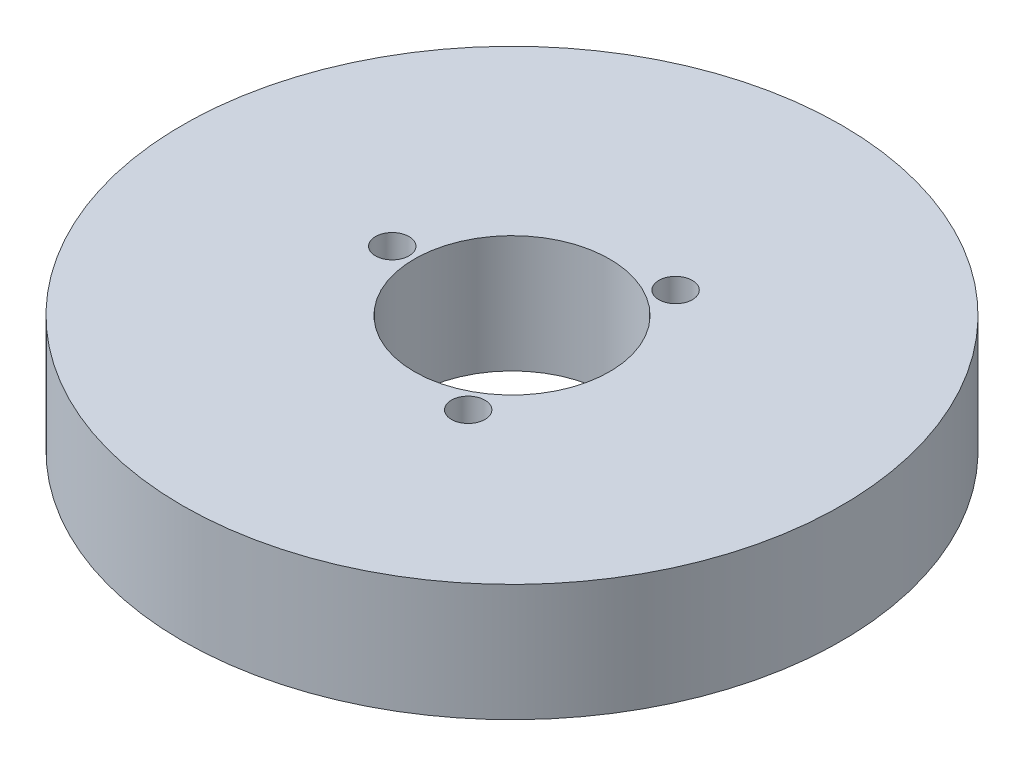
ISO-10303-21;
HEADER;
FILE_DESCRIPTION(('STEP AP214'),'2;1');
FILE_NAME('part.step','',(''),(''),'','','');
FILE_SCHEMA(('AUTOMOTIVE_DESIGN { 1 0 10303 214 1 1 1 1 }'));
ENDSEC;
DATA;
#1=APPLICATION_CONTEXT('core data for automotive mechanical design processes');
#2=APPLICATION_PROTOCOL_DEFINITION('international standard','automotive_design',2000,#1);
#3=PRODUCT_CONTEXT('',#1,'mechanical');
#4=PRODUCT('Part','Part','',(#3));
#5=PRODUCT_RELATED_PRODUCT_CATEGORY('part','',(#4));
#6=PRODUCT_DEFINITION_FORMATION('','',#4);
#7=PRODUCT_DEFINITION_CONTEXT('part definition',#1,'design');
#8=PRODUCT_DEFINITION('design','',#6,#7);
#9=PRODUCT_DEFINITION_SHAPE('','',#8);
#10=(LENGTH_UNIT() NAMED_UNIT(*) SI_UNIT(.MILLI.,.METRE.));
#11=(NAMED_UNIT(*) PLANE_ANGLE_UNIT() SI_UNIT($,.RADIAN.));
#12=(NAMED_UNIT(*) SI_UNIT($,.STERADIAN.) SOLID_ANGLE_UNIT());
#13=UNCERTAINTY_MEASURE_WITH_UNIT(LENGTH_MEASURE(1.E-05),#10,'distance_accuracy_value','');
#14=(GEOMETRIC_REPRESENTATION_CONTEXT(3) GLOBAL_UNCERTAINTY_ASSIGNED_CONTEXT((#13)) GLOBAL_UNIT_ASSIGNED_CONTEXT((#10,
#11,#12)) REPRESENTATION_CONTEXT('',''));
#15=CARTESIAN_POINT('',(0.,0.,0.));
#16=DIRECTION('',(0.,0.,1.));
#17=DIRECTION('',(1.,0.,0.));
#18=AXIS2_PLACEMENT_3D('',#15,#16,#17);
#19=CARTESIAN_POINT('',(0.,24.,0.));
#20=DIRECTION('',(0.,-1.,0.));
#21=DIRECTION('',(0.,0.,-1.));
#22=AXIS2_PLACEMENT_3D('',#19,#20,#21);
#23=CYLINDRICAL_SURFACE('',#22,67.5);
#24=CARTESIAN_POINT('',(0.,24.,0.));
#25=DIRECTION('',(0.,1.,0.));
#26=DIRECTION('',(0.,0.,1.));
#27=AXIS2_PLACEMENT_3D('',#24,#25,#26);
#28=CIRCLE('',#27,67.5);
#29=CARTESIAN_POINT('',(0.,24.,67.5));
#30=VERTEX_POINT('',#29);
#31=EDGE_CURVE('E10',#30,#30,#28,.T.);
#32=ORIENTED_EDGE('',*,*,#31,.F.);
#33=EDGE_LOOP('',(#32));
#34=FACE_BOUND('',#33,.T.);
#35=CARTESIAN_POINT('',(0.,0.,0.));
#36=DIRECTION('',(0.,1.,0.));
#37=DIRECTION('',(0.,0.,1.));
#38=AXIS2_PLACEMENT_3D('',#35,#36,#37);
#39=CIRCLE('',#38,67.5);
#40=CARTESIAN_POINT('',(0.,0.,67.5));
#41=VERTEX_POINT('',#40);
#42=EDGE_CURVE('E37',#41,#41,#39,.T.);
#43=ORIENTED_EDGE('',*,*,#42,.T.);
#44=EDGE_LOOP('',(#43));
#45=FACE_BOUND('',#44,.T.);
#46=ADVANCED_FACE('F40',(#34,#45),#23,.T.);
#47=CARTESIAN_POINT('',(0.,24.,0.));
#48=DIRECTION('',(0.,1.,0.));
#49=DIRECTION('',(0.,0.,1.));
#50=AXIS2_PLACEMENT_3D('',#47,#48,#49);
#51=PLANE('',#50);
#52=CARTESIAN_POINT('',(12.2641494560278,24.,21.2421299694582));
#53=DIRECTION('',(0.,1.,0.));
#54=DIRECTION('',(0.866025403784436,0.,-0.500000000000004));
#55=AXIS2_PLACEMENT_3D('',#52,#53,#54);
#56=CIRCLE('',#55,3.43480526939864);
#57=CARTESIAN_POINT('',(12.2641494560278,24.,24.6769352388568));
#58=VERTEX_POINT('',#57);
#59=EDGE_CURVE('E70',#58,#58,#56,.T.);
#60=ORIENTED_EDGE('',*,*,#59,.F.);
#61=EDGE_LOOP('',(#60));
#62=FACE_BOUND('',#61,.T.);
#63=CARTESIAN_POINT('',(12.2641494560275,24.,-21.2421299694584));
#64=DIRECTION('',(0.,1.,0.));
#65=DIRECTION('',(-0.866025403784443,0.,-0.499999999999992));
#66=AXIS2_PLACEMENT_3D('',#63,#64,#65);
#67=CIRCLE('',#66,3.43480526939864);
#68=CARTESIAN_POINT('',(12.2641494560275,24.,-17.8073247000597));
#69=VERTEX_POINT('',#68);
#70=EDGE_CURVE('E61',#69,#69,#67,.T.);
#71=ORIENTED_EDGE('',*,*,#70,.F.);
#72=EDGE_LOOP('',(#71));
#73=FACE_BOUND('',#72,.T.);
#74=CARTESIAN_POINT('',(-24.5282989120555,24.,0.));
#75=DIRECTION('',(0.,1.,0.));
#76=DIRECTION('',(0.,0.,1.));
#77=AXIS2_PLACEMENT_3D('',#74,#75,#76);
#78=CIRCLE('',#77,3.43480526939864);
#79=CARTESIAN_POINT('',(-24.5282989120555,24.,3.43480526939864));
#80=VERTEX_POINT('',#79);
#81=EDGE_CURVE('E54',#80,#80,#78,.T.);
#82=ORIENTED_EDGE('',*,*,#81,.F.);
#83=EDGE_LOOP('',(#82));
#84=FACE_BOUND('',#83,.T.);
#85=CARTESIAN_POINT('',(0.,24.,0.));
#86=DIRECTION('',(0.,1.,0.));
#87=DIRECTION('',(0.,0.,1.));
#88=AXIS2_PLACEMENT_3D('',#85,#86,#87);
#89=CIRCLE('',#88,20.);
#90=CARTESIAN_POINT('',(0.,24.,20.));
#91=VERTEX_POINT('',#90);
#92=EDGE_CURVE('E50',#91,#91,#89,.T.);
#93=ORIENTED_EDGE('',*,*,#92,.F.);
#94=EDGE_LOOP('',(#93));
#95=FACE_BOUND('',#94,.T.);
#96=ORIENTED_EDGE('',*,*,#31,.T.);
#97=EDGE_LOOP('',(#96));
#98=FACE_BOUND('',#97,.T.);
#99=ADVANCED_FACE('F85',(#62,#73,#84,#95,#98),#51,.T.);
#100=CARTESIAN_POINT('',(0.,0.,0.));
#101=DIRECTION('',(0.,1.,0.));
#102=DIRECTION('',(0.,0.,1.));
#103=AXIS2_PLACEMENT_3D('',#100,#101,#102);
#104=PLANE('',#103);
#105=CARTESIAN_POINT('',(0.,0.,0.));
#106=DIRECTION('',(0.,1.,0.));
#107=DIRECTION('',(0.,0.,1.));
#108=AXIS2_PLACEMENT_3D('',#105,#106,#107);
#109=CIRCLE('',#108,20.);
#110=CARTESIAN_POINT('',(0.,0.,20.));
#111=VERTEX_POINT('',#110);
#112=EDGE_CURVE('E47',#111,#111,#109,.T.);
#113=ORIENTED_EDGE('',*,*,#112,.T.);
#114=EDGE_LOOP('',(#113));
#115=FACE_BOUND('',#114,.T.);
#116=ORIENTED_EDGE('',*,*,#42,.F.);
#117=EDGE_LOOP('',(#116));
#118=FACE_BOUND('',#117,.T.);
#119=ADVANCED_FACE('F84',(#115,#118),#104,.F.);
#120=CARTESIAN_POINT('',(0.,24.,0.));
#121=DIRECTION('',(0.,-1.,0.));
#122=DIRECTION('',(0.,0.,-1.));
#123=AXIS2_PLACEMENT_3D('',#120,#121,#122);
#124=CYLINDRICAL_SURFACE('',#123,20.);
#125=ORIENTED_EDGE('',*,*,#92,.T.);
#126=EDGE_LOOP('',(#125));
#127=FACE_BOUND('',#126,.T.);
#128=ORIENTED_EDGE('',*,*,#112,.F.);
#129=EDGE_LOOP('',(#128));
#130=FACE_BOUND('',#129,.T.);
#131=ADVANCED_FACE('F91',(#127,#130),#124,.F.);
#132=CARTESIAN_POINT('',(-24.5282989120555,5.01780657933037,0.));
#133=DIRECTION('',(0.,1.,0.));
#134=DIRECTION('',(0.,0.,1.));
#135=AXIS2_PLACEMENT_3D('',#132,#133,#134);
#136=CYLINDRICAL_SURFACE('',#135,3.43480526939864);
#137=CARTESIAN_POINT('',(-24.5282989120555,5.01780657933037,0.));
#138=DIRECTION('',(0.,1.,0.));
#139=DIRECTION('',(0.,0.,1.));
#140=AXIS2_PLACEMENT_3D('',#137,#138,#139);
#141=CIRCLE('',#140,3.43480526939864);
#142=CARTESIAN_POINT('',(-24.5282989120555,5.01780657933037,3.43480526939864));
#143=VERTEX_POINT('',#142);
#144=EDGE_CURVE('E55',#143,#143,#141,.T.);
#145=CARTESIAN_POINT('',(-24.5282989120555,5.01780657933037,3.43480526939864));
#146=CARTESIAN_POINT('',(-24.5282989120555,5.21553776079568,3.43480526939864));
#147=CARTESIAN_POINT('',(-24.5282989120555,5.41326894226099,3.43480526939864));
#148=CARTESIAN_POINT('',(-24.5282989120555,5.80873130519161,3.43480526939864));
#149=CARTESIAN_POINT('',(-24.5282989120555,6.00646248665692,3.43480526939864));
#150=CARTESIAN_POINT('',(-24.5282989120555,6.40192484958753,3.43480526939864));
#151=CARTESIAN_POINT('',(-24.5282989120555,6.59965603105284,3.43480526939864));
#152=CARTESIAN_POINT('',(-24.5282989120555,6.99511839398346,3.43480526939864));
#153=CARTESIAN_POINT('',(-24.5282989120555,7.19284957544877,3.43480526939864));
#154=CARTESIAN_POINT('',(-24.5282989120555,7.58831193837939,3.43480526939864));
#155=CARTESIAN_POINT('',(-24.5282989120555,7.7860431198447,3.43480526939864));
#156=CARTESIAN_POINT('',(-24.5282989120555,8.18150548277531,3.43480526939864));
#157=CARTESIAN_POINT('',(-24.5282989120555,8.37923666424062,3.43480526939864));
#158=CARTESIAN_POINT('',(-24.5282989120555,8.77469902717124,3.43480526939864));
#159=CARTESIAN_POINT('',(-24.5282989120555,8.97243020863655,3.43480526939864));
#160=CARTESIAN_POINT('',(-24.5282989120555,9.36789257156716,3.43480526939864));
#161=CARTESIAN_POINT('',(-24.5282989120555,9.56562375303247,3.43480526939864));
#162=CARTESIAN_POINT('',(-24.5282989120555,9.96108611596309,3.43480526939864));
#163=CARTESIAN_POINT('',(-24.5282989120555,10.1588172974284,3.43480526939864));
#164=CARTESIAN_POINT('',(-24.5282989120555,10.554279660359,3.43480526939864));
#165=CARTESIAN_POINT('',(-24.5282989120555,10.7520108418243,3.43480526939864));
#166=CARTESIAN_POINT('',(-24.5282989120555,11.1474732047549,3.43480526939864));
#167=CARTESIAN_POINT('',(-24.5282989120555,11.3452043862202,3.43480526939864));
#168=CARTESIAN_POINT('',(-24.5282989120555,11.7406667491509,3.43480526939864));
#169=CARTESIAN_POINT('',(-24.5282989120555,11.9383979306162,3.43480526939864));
#170=CARTESIAN_POINT('',(-24.5282989120555,12.3338602935468,3.43480526939864));
#171=CARTESIAN_POINT('',(-24.5282989120555,12.5315914750121,3.43480526939864));
#172=CARTESIAN_POINT('',(-24.5282989120555,12.9270538379427,3.43480526939864));
#173=CARTESIAN_POINT('',(-24.5282989120555,13.124785019408,3.43480526939864));
#174=CARTESIAN_POINT('',(-24.5282989120555,13.5202473823386,3.43480526939864));
#175=CARTESIAN_POINT('',(-24.5282989120555,13.717978563804,3.43480526939864));
#176=CARTESIAN_POINT('',(-24.5282989120555,14.1134409267346,3.43480526939864));
#177=CARTESIAN_POINT('',(-24.5282989120555,14.3111721081999,3.43480526939864));
#178=CARTESIAN_POINT('',(-24.5282989120555,14.7066344711305,3.43480526939864));
#179=CARTESIAN_POINT('',(-24.5282989120555,14.9043656525958,3.43480526939864));
#180=CARTESIAN_POINT('',(-24.5282989120555,15.2998280155264,3.43480526939864));
#181=CARTESIAN_POINT('',(-24.5282989120555,15.4975591969917,3.43480526939864));
#182=CARTESIAN_POINT('',(-24.5282989120555,15.8930215599223,3.43480526939864));
#183=CARTESIAN_POINT('',(-24.5282989120555,16.0907527413877,3.43480526939864));
#184=CARTESIAN_POINT('',(-24.5282989120555,16.4862151043183,3.43480526939864));
#185=CARTESIAN_POINT('',(-24.5282989120555,16.6839462857836,3.43480526939864));
#186=CARTESIAN_POINT('',(-24.5282989120555,17.0794086487142,3.43480526939864));
#187=CARTESIAN_POINT('',(-24.5282989120555,17.2771398301795,3.43480526939864));
#188=CARTESIAN_POINT('',(-24.5282989120555,17.6726021931101,3.43480526939864));
#189=CARTESIAN_POINT('',(-24.5282989120555,17.8703333745754,3.43480526939864));
#190=CARTESIAN_POINT('',(-24.5282989120555,18.265795737506,3.43480526939864));
#191=CARTESIAN_POINT('',(-24.5282989120555,18.4635269189714,3.43480526939864));
#192=CARTESIAN_POINT('',(-24.5282989120555,18.858989281902,3.43480526939864));
#193=CARTESIAN_POINT('',(-24.5282989120555,19.0567204633673,3.43480526939864));
#194=CARTESIAN_POINT('',(-24.5282989120555,19.4521828262979,3.43480526939864));
#195=CARTESIAN_POINT('',(-24.5282989120555,19.6499140077632,3.43480526939864));
#196=CARTESIAN_POINT('',(-24.5282989120555,20.0453763706938,3.43480526939864));
#197=CARTESIAN_POINT('',(-24.5282989120555,20.2431075521591,3.43480526939864));
#198=CARTESIAN_POINT('',(-24.5282989120555,20.6385699150898,3.43480526939864));
#199=CARTESIAN_POINT('',(-24.5282989120555,20.8363010965551,3.43480526939864));
#200=CARTESIAN_POINT('',(-24.5282989120555,21.2317634594857,3.43480526939864));
#201=CARTESIAN_POINT('',(-24.5282989120555,21.429494640951,3.43480526939864));
#202=CARTESIAN_POINT('',(-24.5282989120555,21.8249570038816,3.43480526939864));
#203=CARTESIAN_POINT('',(-24.5282989120555,22.0226881853469,3.43480526939864));
#204=CARTESIAN_POINT('',(-24.5282989120555,22.4181505482775,3.43480526939864));
#205=CARTESIAN_POINT('',(-24.5282989120555,22.6158817297428,3.43480526939864));
#206=CARTESIAN_POINT('',(-24.5282989120555,23.0113440926735,3.43480526939864));
#207=CARTESIAN_POINT('',(-24.5282989120555,23.2090752741388,3.43480526939864));
#208=CARTESIAN_POINT('',(-24.5282989120555,23.6045376370694,3.43480526939864));
#209=CARTESIAN_POINT('',(-24.5282989120555,23.8022688185347,3.43480526939864));
#210=CARTESIAN_POINT('',(-24.5282989120555,24.,3.43480526939864));
#211=B_SPLINE_CURVE_WITH_KNOTS('',3,(#145,#146,#147,#148,#149,#150,#151,#152,#153,#154,#155,
#156,#157,#158,#159,#160,#161,#162,#163,#164,#165,#166,#167,#168,#169,#170,#171,#172,#173,#174,
#175,#176,#177,#178,#179,#180,#181,#182,#183,#184,#185,#186,#187,#188,#189,#190,#191,#192,#193,
#194,#195,#196,#197,#198,#199,#200,#201,#202,#203,#204,#205,#206,#207,#208,#209,#210),
.UNSPECIFIED.,.F.,.F.,(4,2,2,2,2,2,2,2,2,2,2,2,2,2,2,2,2,2,2,2,2,2,2,2,2,2,2,2,2,2,2,2,4),(0.,
0.593193544395926,1.18638708879185,1.77958063318778,2.3727741775837,2.96596772197963,
3.55916126637555,4.15235481077148,4.74554835516741,5.33874189956333,5.93193544395926,
6.52512898835518,7.11832253275111,7.71151607714703,8.30470962154296,8.89790316593889,
9.49109671033481,10.0842902547307,10.6774837991267,11.2706773435226,11.8638708879185,
12.4570644323144,13.0502579767104,13.6434515211063,14.2366450655022,14.8298386098981,
15.4230321542941,16.01622569869,16.6094192430859,17.2026127874818,17.7958063318778,
18.3889998762737,18.9821934206696),.UNSPECIFIED.);
#212=EDGE_CURVE('BSEAM96',#143,#80,#211,.T.);
#213=ORIENTED_EDGE('',*,*,#144,.F.);
#214=ORIENTED_EDGE('',*,*,#81,.T.);
#215=ORIENTED_EDGE('',*,*,#212,.T.);
#216=ORIENTED_EDGE('',*,*,#212,.F.);
#217=EDGE_LOOP('',(#213,#215,#214,#216));
#218=FACE_BOUND('',#217,.T.);
#219=ADVANCED_FACE('F96',(#218),#136,.F.);
#220=CARTESIAN_POINT('',(-24.5282989120555,5.01780657933037,0.));
#221=DIRECTION('',(0.,1.,0.));
#222=DIRECTION('',(0.,0.,1.));
#223=AXIS2_PLACEMENT_3D('',#220,#221,#222);
#224=PLANE('',#223);
#225=ORIENTED_EDGE('',*,*,#144,.T.);
#226=EDGE_LOOP('',(#225));
#227=FACE_BOUND('',#226,.T.);
#228=ADVANCED_FACE('F127',(#227),#224,.T.);
#229=CARTESIAN_POINT('',(12.2641494560275,5.01780657933037,-21.2421299694584));
#230=DIRECTION('',(0.,1.,0.));
#231=DIRECTION('',(0.,0.,1.));
#232=AXIS2_PLACEMENT_3D('',#229,#230,#231);
#233=CYLINDRICAL_SURFACE('',#232,3.43480526939864);
#234=CARTESIAN_POINT('',(12.2641494560275,5.01780657933037,-21.2421299694584));
#235=DIRECTION('',(0.,1.,0.));
#236=DIRECTION('',(-0.866025403784443,0.,-0.499999999999992));
#237=AXIS2_PLACEMENT_3D('',#234,#235,#236);
#238=CIRCLE('',#237,3.43480526939864);
#239=CARTESIAN_POINT('',(12.2641494560275,5.01780657933037,-17.8073247000597));
#240=VERTEX_POINT('',#239);
#241=EDGE_CURVE('E63',#240,#240,#238,.T.);
#242=CARTESIAN_POINT('',(12.2641494560275,5.01780657933037,-17.8073247000597));
#243=CARTESIAN_POINT('',(12.2641494560275,5.21553776079568,-17.8073247000597));
#244=CARTESIAN_POINT('',(12.2641494560275,5.41326894226099,-17.8073247000597));
#245=CARTESIAN_POINT('',(12.2641494560275,5.80873130519161,-17.8073247000597));
#246=CARTESIAN_POINT('',(12.2641494560275,6.00646248665692,-17.8073247000597));
#247=CARTESIAN_POINT('',(12.2641494560275,6.40192484958753,-17.8073247000597));
#248=CARTESIAN_POINT('',(12.2641494560275,6.59965603105284,-17.8073247000597));
#249=CARTESIAN_POINT('',(12.2641494560275,6.99511839398346,-17.8073247000597));
#250=CARTESIAN_POINT('',(12.2641494560275,7.19284957544877,-17.8073247000597));
#251=CARTESIAN_POINT('',(12.2641494560275,7.58831193837939,-17.8073247000597));
#252=CARTESIAN_POINT('',(12.2641494560275,7.7860431198447,-17.8073247000597));
#253=CARTESIAN_POINT('',(12.2641494560275,8.18150548277531,-17.8073247000597));
#254=CARTESIAN_POINT('',(12.2641494560275,8.37923666424062,-17.8073247000597));
#255=CARTESIAN_POINT('',(12.2641494560275,8.77469902717124,-17.8073247000597));
#256=CARTESIAN_POINT('',(12.2641494560275,8.97243020863655,-17.8073247000597));
#257=CARTESIAN_POINT('',(12.2641494560275,9.36789257156716,-17.8073247000597));
#258=CARTESIAN_POINT('',(12.2641494560275,9.56562375303247,-17.8073247000597));
#259=CARTESIAN_POINT('',(12.2641494560275,9.96108611596309,-17.8073247000597));
#260=CARTESIAN_POINT('',(12.2641494560275,10.1588172974284,-17.8073247000597));
#261=CARTESIAN_POINT('',(12.2641494560275,10.554279660359,-17.8073247000597));
#262=CARTESIAN_POINT('',(12.2641494560275,10.7520108418243,-17.8073247000597));
#263=CARTESIAN_POINT('',(12.2641494560275,11.1474732047549,-17.8073247000597));
#264=CARTESIAN_POINT('',(12.2641494560275,11.3452043862202,-17.8073247000597));
#265=CARTESIAN_POINT('',(12.2641494560275,11.7406667491509,-17.8073247000597));
#266=CARTESIAN_POINT('',(12.2641494560275,11.9383979306162,-17.8073247000597));
#267=CARTESIAN_POINT('',(12.2641494560275,12.3338602935468,-17.8073247000597));
#268=CARTESIAN_POINT('',(12.2641494560275,12.5315914750121,-17.8073247000597));
#269=CARTESIAN_POINT('',(12.2641494560275,12.9270538379427,-17.8073247000597));
#270=CARTESIAN_POINT('',(12.2641494560275,13.124785019408,-17.8073247000597));
#271=CARTESIAN_POINT('',(12.2641494560275,13.5202473823386,-17.8073247000597));
#272=CARTESIAN_POINT('',(12.2641494560275,13.717978563804,-17.8073247000597));
#273=CARTESIAN_POINT('',(12.2641494560275,14.1134409267346,-17.8073247000597));
#274=CARTESIAN_POINT('',(12.2641494560275,14.3111721081999,-17.8073247000597));
#275=CARTESIAN_POINT('',(12.2641494560275,14.7066344711305,-17.8073247000597));
#276=CARTESIAN_POINT('',(12.2641494560275,14.9043656525958,-17.8073247000597));
#277=CARTESIAN_POINT('',(12.2641494560275,15.2998280155264,-17.8073247000597));
#278=CARTESIAN_POINT('',(12.2641494560275,15.4975591969917,-17.8073247000597));
#279=CARTESIAN_POINT('',(12.2641494560275,15.8930215599223,-17.8073247000597));
#280=CARTESIAN_POINT('',(12.2641494560275,16.0907527413877,-17.8073247000597));
#281=CARTESIAN_POINT('',(12.2641494560275,16.4862151043183,-17.8073247000597));
#282=CARTESIAN_POINT('',(12.2641494560275,16.6839462857836,-17.8073247000597));
#283=CARTESIAN_POINT('',(12.2641494560275,17.0794086487142,-17.8073247000597));
#284=CARTESIAN_POINT('',(12.2641494560275,17.2771398301795,-17.8073247000597));
#285=CARTESIAN_POINT('',(12.2641494560275,17.6726021931101,-17.8073247000597));
#286=CARTESIAN_POINT('',(12.2641494560275,17.8703333745754,-17.8073247000597));
#287=CARTESIAN_POINT('',(12.2641494560275,18.265795737506,-17.8073247000597));
#288=CARTESIAN_POINT('',(12.2641494560275,18.4635269189714,-17.8073247000597));
#289=CARTESIAN_POINT('',(12.2641494560275,18.858989281902,-17.8073247000597));
#290=CARTESIAN_POINT('',(12.2641494560275,19.0567204633673,-17.8073247000597));
#291=CARTESIAN_POINT('',(12.2641494560275,19.4521828262979,-17.8073247000597));
#292=CARTESIAN_POINT('',(12.2641494560275,19.6499140077632,-17.8073247000597));
#293=CARTESIAN_POINT('',(12.2641494560275,20.0453763706938,-17.8073247000597));
#294=CARTESIAN_POINT('',(12.2641494560275,20.2431075521591,-17.8073247000597));
#295=CARTESIAN_POINT('',(12.2641494560275,20.6385699150898,-17.8073247000597));
#296=CARTESIAN_POINT('',(12.2641494560275,20.8363010965551,-17.8073247000597));
#297=CARTESIAN_POINT('',(12.2641494560275,21.2317634594857,-17.8073247000597));
#298=CARTESIAN_POINT('',(12.2641494560275,21.429494640951,-17.8073247000597));
#299=CARTESIAN_POINT('',(12.2641494560275,21.8249570038816,-17.8073247000597));
#300=CARTESIAN_POINT('',(12.2641494560275,22.0226881853469,-17.8073247000597));
#301=CARTESIAN_POINT('',(12.2641494560275,22.4181505482775,-17.8073247000597));
#302=CARTESIAN_POINT('',(12.2641494560275,22.6158817297428,-17.8073247000597));
#303=CARTESIAN_POINT('',(12.2641494560275,23.0113440926735,-17.8073247000597));
#304=CARTESIAN_POINT('',(12.2641494560275,23.2090752741388,-17.8073247000597));
#305=CARTESIAN_POINT('',(12.2641494560275,23.6045376370694,-17.8073247000597));
#306=CARTESIAN_POINT('',(12.2641494560275,23.8022688185347,-17.8073247000597));
#307=CARTESIAN_POINT('',(12.2641494560275,24.,-17.8073247000597));
#308=B_SPLINE_CURVE_WITH_KNOTS('',3,(#242,#243,#244,#245,#246,#247,#248,#249,#250,#251,#252,
#253,#254,#255,#256,#257,#258,#259,#260,#261,#262,#263,#264,#265,#266,#267,#268,#269,#270,#271,
#272,#273,#274,#275,#276,#277,#278,#279,#280,#281,#282,#283,#284,#285,#286,#287,#288,#289,#290,
#291,#292,#293,#294,#295,#296,#297,#298,#299,#300,#301,#302,#303,#304,#305,#306,#307),
.UNSPECIFIED.,.F.,.F.,(4,2,2,2,2,2,2,2,2,2,2,2,2,2,2,2,2,2,2,2,2,2,2,2,2,2,2,2,2,2,2,2,4),(0.,
0.593193544395926,1.18638708879185,1.77958063318778,2.3727741775837,2.96596772197963,
3.55916126637555,4.15235481077148,4.74554835516741,5.33874189956333,5.93193544395926,
6.52512898835518,7.11832253275111,7.71151607714703,8.30470962154296,8.89790316593889,
9.49109671033481,10.0842902547307,10.6774837991267,11.2706773435226,11.8638708879185,
12.4570644323144,13.0502579767104,13.6434515211063,14.2366450655022,14.8298386098981,
15.4230321542941,16.01622569869,16.6094192430859,17.2026127874818,17.7958063318778,
18.3889998762737,18.9821934206696),.UNSPECIFIED.);
#309=EDGE_CURVE('BSEAM133',#240,#69,#308,.T.);
#310=ORIENTED_EDGE('',*,*,#241,.F.);
#311=ORIENTED_EDGE('',*,*,#70,.T.);
#312=ORIENTED_EDGE('',*,*,#309,.T.);
#313=ORIENTED_EDGE('',*,*,#309,.F.);
#314=EDGE_LOOP('',(#310,#312,#311,#313));
#315=FACE_BOUND('',#314,.T.);
#316=ADVANCED_FACE('F133',(#315),#233,.F.);
#317=CARTESIAN_POINT('',(12.2641494560275,5.01780657933037,-21.2421299694584));
#318=DIRECTION('',(0.,1.,0.));
#319=DIRECTION('',(-0.866025403784443,0.,-0.499999999999992));
#320=AXIS2_PLACEMENT_3D('',#317,#318,#319);
#321=PLANE('',#320);
#322=ORIENTED_EDGE('',*,*,#241,.T.);
#323=EDGE_LOOP('',(#322));
#324=FACE_BOUND('',#323,.T.);
#325=ADVANCED_FACE('F77',(#324),#321,.T.);
#326=CARTESIAN_POINT('',(12.2641494560278,5.01780657933037,21.2421299694582));
#327=DIRECTION('',(0.,1.,0.));
#328=DIRECTION('',(0.,0.,1.));
#329=AXIS2_PLACEMENT_3D('',#326,#327,#328);
#330=CYLINDRICAL_SURFACE('',#329,3.43480526939864);
#331=CARTESIAN_POINT('',(12.2641494560278,5.01780657933037,21.2421299694582));
#332=DIRECTION('',(0.,1.,0.));
#333=DIRECTION('',(0.866025403784436,0.,-0.500000000000004));
#334=AXIS2_PLACEMENT_3D('',#331,#332,#333);
#335=CIRCLE('',#334,3.43480526939864);
#336=CARTESIAN_POINT('',(12.2641494560278,5.01780657933037,24.6769352388568));
#337=VERTEX_POINT('',#336);
#338=EDGE_CURVE('E59',#337,#337,#335,.T.);
#339=CARTESIAN_POINT('',(12.2641494560278,5.01780657933037,24.6769352388568));
#340=CARTESIAN_POINT('',(12.2641494560278,5.21553776079568,24.6769352388568));
#341=CARTESIAN_POINT('',(12.2641494560278,5.41326894226099,24.6769352388568));
#342=CARTESIAN_POINT('',(12.2641494560278,5.80873130519161,24.6769352388568));
#343=CARTESIAN_POINT('',(12.2641494560278,6.00646248665692,24.6769352388568));
#344=CARTESIAN_POINT('',(12.2641494560278,6.40192484958753,24.6769352388568));
#345=CARTESIAN_POINT('',(12.2641494560278,6.59965603105284,24.6769352388568));
#346=CARTESIAN_POINT('',(12.2641494560278,6.99511839398346,24.6769352388568));
#347=CARTESIAN_POINT('',(12.2641494560278,7.19284957544877,24.6769352388568));
#348=CARTESIAN_POINT('',(12.2641494560278,7.58831193837939,24.6769352388568));
#349=CARTESIAN_POINT('',(12.2641494560278,7.7860431198447,24.6769352388568));
#350=CARTESIAN_POINT('',(12.2641494560278,8.18150548277531,24.6769352388568));
#351=CARTESIAN_POINT('',(12.2641494560278,8.37923666424062,24.6769352388568));
#352=CARTESIAN_POINT('',(12.2641494560278,8.77469902717124,24.6769352388568));
#353=CARTESIAN_POINT('',(12.2641494560278,8.97243020863655,24.6769352388568));
#354=CARTESIAN_POINT('',(12.2641494560278,9.36789257156716,24.6769352388568));
#355=CARTESIAN_POINT('',(12.2641494560278,9.56562375303247,24.6769352388568));
#356=CARTESIAN_POINT('',(12.2641494560278,9.96108611596309,24.6769352388568));
#357=CARTESIAN_POINT('',(12.2641494560278,10.1588172974284,24.6769352388568));
#358=CARTESIAN_POINT('',(12.2641494560278,10.554279660359,24.6769352388568));
#359=CARTESIAN_POINT('',(12.2641494560278,10.7520108418243,24.6769352388568));
#360=CARTESIAN_POINT('',(12.2641494560278,11.1474732047549,24.6769352388568));
#361=CARTESIAN_POINT('',(12.2641494560278,11.3452043862202,24.6769352388568));
#362=CARTESIAN_POINT('',(12.2641494560278,11.7406667491509,24.6769352388568));
#363=CARTESIAN_POINT('',(12.2641494560278,11.9383979306162,24.6769352388568));
#364=CARTESIAN_POINT('',(12.2641494560278,12.3338602935468,24.6769352388568));
#365=CARTESIAN_POINT('',(12.2641494560278,12.5315914750121,24.6769352388568));
#366=CARTESIAN_POINT('',(12.2641494560278,12.9270538379427,24.6769352388568));
#367=CARTESIAN_POINT('',(12.2641494560278,13.124785019408,24.6769352388568));
#368=CARTESIAN_POINT('',(12.2641494560278,13.5202473823386,24.6769352388568));
#369=CARTESIAN_POINT('',(12.2641494560278,13.717978563804,24.6769352388568));
#370=CARTESIAN_POINT('',(12.2641494560278,14.1134409267346,24.6769352388568));
#371=CARTESIAN_POINT('',(12.2641494560278,14.3111721081999,24.6769352388568));
#372=CARTESIAN_POINT('',(12.2641494560278,14.7066344711305,24.6769352388568));
#373=CARTESIAN_POINT('',(12.2641494560278,14.9043656525958,24.6769352388568));
#374=CARTESIAN_POINT('',(12.2641494560278,15.2998280155264,24.6769352388568));
#375=CARTESIAN_POINT('',(12.2641494560278,15.4975591969917,24.6769352388568));
#376=CARTESIAN_POINT('',(12.2641494560278,15.8930215599223,24.6769352388568));
#377=CARTESIAN_POINT('',(12.2641494560278,16.0907527413877,24.6769352388568));
#378=CARTESIAN_POINT('',(12.2641494560278,16.4862151043183,24.6769352388568));
#379=CARTESIAN_POINT('',(12.2641494560278,16.6839462857836,24.6769352388568));
#380=CARTESIAN_POINT('',(12.2641494560278,17.0794086487142,24.6769352388568));
#381=CARTESIAN_POINT('',(12.2641494560278,17.2771398301795,24.6769352388568));
#382=CARTESIAN_POINT('',(12.2641494560278,17.6726021931101,24.6769352388568));
#383=CARTESIAN_POINT('',(12.2641494560278,17.8703333745754,24.6769352388568));
#384=CARTESIAN_POINT('',(12.2641494560278,18.265795737506,24.6769352388568));
#385=CARTESIAN_POINT('',(12.2641494560278,18.4635269189714,24.6769352388568));
#386=CARTESIAN_POINT('',(12.2641494560278,18.858989281902,24.6769352388568));
#387=CARTESIAN_POINT('',(12.2641494560278,19.0567204633673,24.6769352388568));
#388=CARTESIAN_POINT('',(12.2641494560278,19.4521828262979,24.6769352388568));
#389=CARTESIAN_POINT('',(12.2641494560278,19.6499140077632,24.6769352388568));
#390=CARTESIAN_POINT('',(12.2641494560278,20.0453763706938,24.6769352388568));
#391=CARTESIAN_POINT('',(12.2641494560278,20.2431075521591,24.6769352388568));
#392=CARTESIAN_POINT('',(12.2641494560278,20.6385699150898,24.6769352388568));
#393=CARTESIAN_POINT('',(12.2641494560278,20.8363010965551,24.6769352388568));
#394=CARTESIAN_POINT('',(12.2641494560278,21.2317634594857,24.6769352388568));
#395=CARTESIAN_POINT('',(12.2641494560278,21.429494640951,24.6769352388568));
#396=CARTESIAN_POINT('',(12.2641494560278,21.8249570038816,24.6769352388568));
#397=CARTESIAN_POINT('',(12.2641494560278,22.0226881853469,24.6769352388568));
#398=CARTESIAN_POINT('',(12.2641494560278,22.4181505482775,24.6769352388568));
#399=CARTESIAN_POINT('',(12.2641494560278,22.6158817297428,24.6769352388568));
#400=CARTESIAN_POINT('',(12.2641494560278,23.0113440926735,24.6769352388568));
#401=CARTESIAN_POINT('',(12.2641494560278,23.2090752741388,24.6769352388568));
#402=CARTESIAN_POINT('',(12.2641494560278,23.6045376370694,24.6769352388568));
#403=CARTESIAN_POINT('',(12.2641494560278,23.8022688185347,24.6769352388568));
#404=CARTESIAN_POINT('',(12.2641494560278,24.,24.6769352388568));
#405=B_SPLINE_CURVE_WITH_KNOTS('',3,(#339,#340,#341,#342,#343,#344,#345,#346,#347,#348,#349,
#350,#351,#352,#353,#354,#355,#356,#357,#358,#359,#360,#361,#362,#363,#364,#365,#366,#367,#368,
#369,#370,#371,#372,#373,#374,#375,#376,#377,#378,#379,#380,#381,#382,#383,#384,#385,#386,#387,
#388,#389,#390,#391,#392,#393,#394,#395,#396,#397,#398,#399,#400,#401,#402,#403,#404),
.UNSPECIFIED.,.F.,.F.,(4,2,2,2,2,2,2,2,2,2,2,2,2,2,2,2,2,2,2,2,2,2,2,2,2,2,2,2,2,2,2,2,4),(0.,
0.593193544395926,1.18638708879185,1.77958063318778,2.3727741775837,2.96596772197963,
3.55916126637555,4.15235481077148,4.74554835516741,5.33874189956333,5.93193544395926,
6.52512898835518,7.11832253275111,7.71151607714703,8.30470962154296,8.89790316593889,
9.49109671033481,10.0842902547307,10.6774837991267,11.2706773435226,11.8638708879185,
12.4570644323144,13.0502579767104,13.6434515211063,14.2366450655022,14.8298386098981,
15.4230321542941,16.01622569869,16.6094192430859,17.2026127874818,17.7958063318778,
18.3889998762737,18.9821934206696),.UNSPECIFIED.);
#406=EDGE_CURVE('BSEAM73',#337,#58,#405,.T.);
#407=ORIENTED_EDGE('',*,*,#338,.F.);
#408=ORIENTED_EDGE('',*,*,#59,.T.);
#409=ORIENTED_EDGE('',*,*,#406,.T.);
#410=ORIENTED_EDGE('',*,*,#406,.F.);
#411=EDGE_LOOP('',(#407,#409,#408,#410));
#412=FACE_BOUND('',#411,.T.);
#413=ADVANCED_FACE('F73',(#412),#330,.F.);
#414=CARTESIAN_POINT('',(12.2641494560278,5.01780657933037,21.2421299694582));
#415=DIRECTION('',(0.,1.,0.));
#416=DIRECTION('',(0.866025403784436,0.,-0.500000000000004));
#417=AXIS2_PLACEMENT_3D('',#414,#415,#416);
#418=PLANE('',#417);
#419=ORIENTED_EDGE('',*,*,#338,.T.);
#420=EDGE_LOOP('',(#419));
#421=FACE_BOUND('',#420,.T.);
#422=ADVANCED_FACE('F71',(#421),#418,.T.);
#423=CLOSED_SHELL('',(#46,#99,#119,#131,#219,#228,#316,#325,#413,#422));
#424=MANIFOLD_SOLID_BREP('B2',#423);
#425=ADVANCED_BREP_SHAPE_REPRESENTATION('',(#18,#424),#14);
#426=SHAPE_DEFINITION_REPRESENTATION(#9,#425);
ENDSEC;
END-ISO-10303-21;
